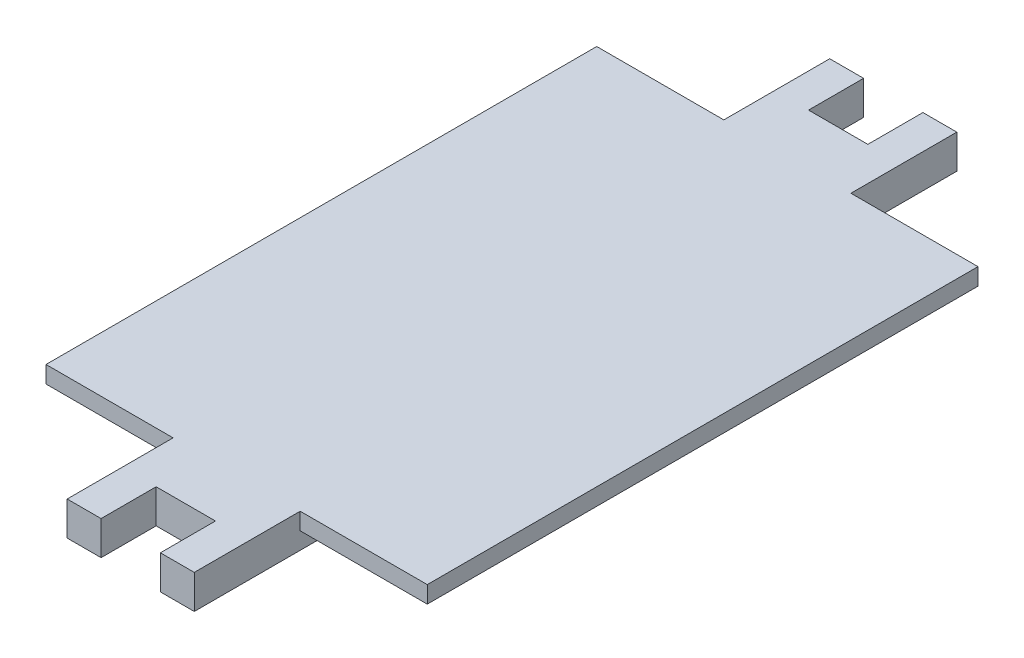
ISO-10303-21;
HEADER;
FILE_DESCRIPTION(('STEP AP214'),'2;1');
FILE_NAME('part.step','',(''),(''),'','','');
FILE_SCHEMA(('AUTOMOTIVE_DESIGN { 1 0 10303 214 1 1 1 1 }'));
ENDSEC;
DATA;
#1=APPLICATION_CONTEXT('core data for automotive mechanical design processes');
#2=APPLICATION_PROTOCOL_DEFINITION('international standard','automotive_design',2000,#1);
#3=PRODUCT_CONTEXT('',#1,'mechanical');
#4=PRODUCT('Part','Part','',(#3));
#5=PRODUCT_RELATED_PRODUCT_CATEGORY('part','',(#4));
#6=PRODUCT_DEFINITION_FORMATION('','',#4);
#7=PRODUCT_DEFINITION_CONTEXT('part definition',#1,'design');
#8=PRODUCT_DEFINITION('design','',#6,#7);
#9=PRODUCT_DEFINITION_SHAPE('','',#8);
#10=(LENGTH_UNIT() NAMED_UNIT(*) SI_UNIT(.MILLI.,.METRE.));
#11=(NAMED_UNIT(*) PLANE_ANGLE_UNIT() SI_UNIT($,.RADIAN.));
#12=(NAMED_UNIT(*) SI_UNIT($,.STERADIAN.) SOLID_ANGLE_UNIT());
#13=UNCERTAINTY_MEASURE_WITH_UNIT(LENGTH_MEASURE(1.E-05),#10,'distance_accuracy_value','');
#14=(GEOMETRIC_REPRESENTATION_CONTEXT(3) GLOBAL_UNCERTAINTY_ASSIGNED_CONTEXT((#13)) GLOBAL_UNIT_ASSIGNED_CONTEXT((#10,
#11,#12)) REPRESENTATION_CONTEXT('',''));
#15=CARTESIAN_POINT('',(0.,0.,0.));
#16=DIRECTION('',(0.,0.,1.));
#17=DIRECTION('',(1.,0.,0.));
#18=AXIS2_PLACEMENT_3D('',#15,#16,#17);
#19=CARTESIAN_POINT('',(0.,0.,-1.925));
#20=DIRECTION('',(0.,0.,-1.));
#21=DIRECTION('',(-1.,0.,0.));
#22=AXIS2_PLACEMENT_3D('',#19,#20,#21);
#23=PLANE('',#22);
#24=DIRECTION('',(0.,1.,0.));
#25=VECTOR('',#24,1.);
#26=CARTESIAN_POINT('',(-0.175,0.,-1.925));
#27=LINE('',#26,#25);
#28=CARTESIAN_POINT('',(-0.175,0.,-1.925));
#29=VERTEX_POINT('',#28);
#30=CARTESIAN_POINT('',(-0.175,0.2,-1.925));
#31=VERTEX_POINT('',#30);
#32=EDGE_CURVE('E11',#29,#31,#27,.T.);
#33=ORIENTED_EDGE('',*,*,#32,.T.);
#34=DIRECTION('',(1.,0.,0.));
#35=VECTOR('',#34,1.);
#36=CARTESIAN_POINT('',(-0.175,0.2,-1.925));
#37=LINE('',#36,#35);
#38=CARTESIAN_POINT('',(0.175,0.2,-1.925));
#39=VERTEX_POINT('',#38);
#40=EDGE_CURVE('E24',#31,#39,#37,.T.);
#41=ORIENTED_EDGE('',*,*,#40,.T.);
#42=DIRECTION('',(0.,1.,0.));
#43=VECTOR('',#42,1.);
#44=CARTESIAN_POINT('',(0.175,0.,-1.925));
#45=LINE('',#44,#43);
#46=CARTESIAN_POINT('',(0.175,0.,-1.925));
#47=VERTEX_POINT('',#46);
#48=EDGE_CURVE('E432',#47,#39,#45,.T.);
#49=ORIENTED_EDGE('',*,*,#48,.F.);
#50=DIRECTION('',(1.,0.,0.));
#51=VECTOR('',#50,1.);
#52=CARTESIAN_POINT('',(-0.175,0.,-1.925));
#53=LINE('',#52,#51);
#54=EDGE_CURVE('E36',#29,#47,#53,.T.);
#55=ORIENTED_EDGE('',*,*,#54,.F.);
#56=EDGE_LOOP('',(#33,#41,#49,#55));
#57=FACE_BOUND('',#56,.T.);
#58=ADVANCED_FACE('F17',(#57),#23,.T.);
#59=CARTESIAN_POINT('',(0.,0.,0.));
#60=DIRECTION('',(0.,-1.,0.));
#61=DIRECTION('',(-1.,0.,0.));
#62=AXIS2_PLACEMENT_3D('',#59,#60,#61);
#63=PLANE('',#62);
#64=DIRECTION('',(0.,0.,1.));
#65=VECTOR('',#64,1.);
#66=CARTESIAN_POINT('',(-0.175,0.,1.925));
#67=LINE('',#66,#65);
#68=CARTESIAN_POINT('',(-0.175,0.,1.925));
#69=VERTEX_POINT('',#68);
#70=CARTESIAN_POINT('',(-0.175,0.,2.25));
#71=VERTEX_POINT('',#70);
#72=EDGE_CURVE('E428',#69,#71,#67,.T.);
#73=ORIENTED_EDGE('',*,*,#72,.T.);
#74=DIRECTION('',(-1.,0.,0.));
#75=VECTOR('',#74,1.);
#76=CARTESIAN_POINT('',(-0.175,0.,2.25));
#77=LINE('',#76,#75);
#78=CARTESIAN_POINT('',(-0.375,0.,2.25));
#79=VERTEX_POINT('',#78);
#80=EDGE_CURVE('E425',#71,#79,#77,.T.);
#81=ORIENTED_EDGE('',*,*,#80,.T.);
#82=DIRECTION('',(0.,0.,-1.));
#83=VECTOR('',#82,1.);
#84=CARTESIAN_POINT('',(-0.375,0.,2.25));
#85=LINE('',#84,#83);
#86=CARTESIAN_POINT('',(-0.375,0.,1.525));
#87=VERTEX_POINT('',#86);
#88=EDGE_CURVE('E422',#79,#87,#85,.T.);
#89=ORIENTED_EDGE('',*,*,#88,.T.);
#90=DIRECTION('',(-1.,0.,0.));
#91=VECTOR('',#90,1.);
#92=CARTESIAN_POINT('',(-0.375,0.,1.525));
#93=LINE('',#92,#91);
#94=CARTESIAN_POINT('',(-1.025,0.,1.525));
#95=VERTEX_POINT('',#94);
#96=EDGE_CURVE('E419',#87,#95,#93,.T.);
#97=ORIENTED_EDGE('',*,*,#96,.T.);
#98=DIRECTION('',(0.,0.,-1.));
#99=VECTOR('',#98,1.);
#100=CARTESIAN_POINT('',(-1.025,0.,1.525));
#101=LINE('',#100,#99);
#102=CARTESIAN_POINT('',(-1.025,0.,-1.175));
#103=VERTEX_POINT('',#102);
#104=EDGE_CURVE('E416',#95,#103,#101,.T.);
#105=ORIENTED_EDGE('',*,*,#104,.T.);
#106=DIRECTION('',(0.707106781186548,0.,-0.707106781186548));
#107=VECTOR('',#106,1.);
#108=CARTESIAN_POINT('',(-1.025,0.,-1.175));
#109=LINE('',#108,#107);
#110=CARTESIAN_POINT('',(-0.675,0.,-1.525));
#111=VERTEX_POINT('',#110);
#112=EDGE_CURVE('E413',#103,#111,#109,.T.);
#113=ORIENTED_EDGE('',*,*,#112,.T.);
#114=DIRECTION('',(1.,0.,0.));
#115=VECTOR('',#114,1.);
#116=CARTESIAN_POINT('',(-0.675,0.,-1.525));
#117=LINE('',#116,#115);
#118=CARTESIAN_POINT('',(-0.375,0.,-1.525));
#119=VERTEX_POINT('',#118);
#120=EDGE_CURVE('E410',#111,#119,#117,.T.);
#121=ORIENTED_EDGE('',*,*,#120,.T.);
#122=DIRECTION('',(0.,0.,1.));
#123=VECTOR('',#122,1.);
#124=CARTESIAN_POINT('',(-0.375,0.,-2.25));
#125=LINE('',#124,#123);
#126=CARTESIAN_POINT('',(-0.375,0.,-2.25));
#127=VERTEX_POINT('',#126);
#128=EDGE_CURVE('E408',#127,#119,#125,.T.);
#129=ORIENTED_EDGE('',*,*,#128,.F.);
#130=DIRECTION('',(-1.,0.,0.));
#131=VECTOR('',#130,1.);
#132=CARTESIAN_POINT('',(-0.175,0.,-2.25));
#133=LINE('',#132,#131);
#134=CARTESIAN_POINT('',(-0.175,0.,-2.25));
#135=VERTEX_POINT('',#134);
#136=EDGE_CURVE('E406',#135,#127,#133,.T.);
#137=ORIENTED_EDGE('',*,*,#136,.F.);
#138=DIRECTION('',(0.,0.,-1.));
#139=VECTOR('',#138,1.);
#140=CARTESIAN_POINT('',(-0.175,0.,-1.925));
#141=LINE('',#140,#139);
#142=EDGE_CURVE('E404',#29,#135,#141,.T.);
#143=ORIENTED_EDGE('',*,*,#142,.F.);
#144=ORIENTED_EDGE('',*,*,#54,.T.);
#145=DIRECTION('',(0.,0.,-1.));
#146=VECTOR('',#145,1.);
#147=CARTESIAN_POINT('',(0.175,0.,-1.925));
#148=LINE('',#147,#146);
#149=CARTESIAN_POINT('',(0.175,0.,-2.25));
#150=VERTEX_POINT('',#149);
#151=EDGE_CURVE('E401',#47,#150,#148,.T.);
#152=ORIENTED_EDGE('',*,*,#151,.T.);
#153=DIRECTION('',(1.,0.,0.));
#154=VECTOR('',#153,1.);
#155=CARTESIAN_POINT('',(0.175,0.,-2.25));
#156=LINE('',#155,#154);
#157=CARTESIAN_POINT('',(0.375,0.,-2.25));
#158=VERTEX_POINT('',#157);
#159=EDGE_CURVE('E398',#150,#158,#156,.T.);
#160=ORIENTED_EDGE('',*,*,#159,.T.);
#161=DIRECTION('',(0.,0.,1.));
#162=VECTOR('',#161,1.);
#163=CARTESIAN_POINT('',(0.375,0.,-2.25));
#164=LINE('',#163,#162);
#165=CARTESIAN_POINT('',(0.375,0.,-1.525));
#166=VERTEX_POINT('',#165);
#167=EDGE_CURVE('E395',#158,#166,#164,.T.);
#168=ORIENTED_EDGE('',*,*,#167,.T.);
#169=DIRECTION('',(1.,0.,0.));
#170=VECTOR('',#169,1.);
#171=CARTESIAN_POINT('',(0.375,0.,-1.525));
#172=LINE('',#171,#170);
#173=CARTESIAN_POINT('',(1.025,0.,-1.525));
#174=VERTEX_POINT('',#173);
#175=EDGE_CURVE('E392',#166,#174,#172,.T.);
#176=ORIENTED_EDGE('',*,*,#175,.T.);
#177=DIRECTION('',(0.,0.,1.));
#178=VECTOR('',#177,1.);
#179=CARTESIAN_POINT('',(1.025,0.,-1.525));
#180=LINE('',#179,#178);
#181=CARTESIAN_POINT('',(1.025,0.,1.525));
#182=VERTEX_POINT('',#181);
#183=EDGE_CURVE('E389',#174,#182,#180,.T.);
#184=ORIENTED_EDGE('',*,*,#183,.T.);
#185=DIRECTION('',(-1.,0.,0.));
#186=VECTOR('',#185,1.);
#187=CARTESIAN_POINT('',(1.025,0.,1.525));
#188=LINE('',#187,#186);
#189=CARTESIAN_POINT('',(0.375,0.,1.525));
#190=VERTEX_POINT('',#189);
#191=EDGE_CURVE('E386',#182,#190,#188,.T.);
#192=ORIENTED_EDGE('',*,*,#191,.T.);
#193=DIRECTION('',(0.,0.,-1.));
#194=VECTOR('',#193,1.);
#195=CARTESIAN_POINT('',(0.375,0.,2.25));
#196=LINE('',#195,#194);
#197=CARTESIAN_POINT('',(0.375,0.,2.25));
#198=VERTEX_POINT('',#197);
#199=EDGE_CURVE('E384',#198,#190,#196,.T.);
#200=ORIENTED_EDGE('',*,*,#199,.F.);
#201=DIRECTION('',(1.,0.,0.));
#202=VECTOR('',#201,1.);
#203=CARTESIAN_POINT('',(0.175,0.,2.25));
#204=LINE('',#203,#202);
#205=CARTESIAN_POINT('',(0.175,0.,2.25));
#206=VERTEX_POINT('',#205);
#207=EDGE_CURVE('E382',#206,#198,#204,.T.);
#208=ORIENTED_EDGE('',*,*,#207,.F.);
#209=DIRECTION('',(0.,0.,1.));
#210=VECTOR('',#209,1.);
#211=CARTESIAN_POINT('',(0.175,0.,1.925));
#212=LINE('',#211,#210);
#213=CARTESIAN_POINT('',(0.175,0.,1.925));
#214=VERTEX_POINT('',#213);
#215=EDGE_CURVE('E380',#214,#206,#212,.T.);
#216=ORIENTED_EDGE('',*,*,#215,.F.);
#217=DIRECTION('',(-1.,0.,0.));
#218=VECTOR('',#217,1.);
#219=CARTESIAN_POINT('',(0.175,0.,1.925));
#220=LINE('',#219,#218);
#221=EDGE_CURVE('E378',#214,#69,#220,.T.);
#222=ORIENTED_EDGE('',*,*,#221,.T.);
#223=EDGE_LOOP('',(#73,#81,#89,#97,#105,#113,#121,#129,#137,#143,#144,#152,#160,#168,#176,#184,
#192,#200,#208,#216,#222));
#224=FACE_BOUND('',#223,.T.);
#225=ADVANCED_FACE('F444',(#224),#63,.T.);
#226=CARTESIAN_POINT('',(0.,0.,1.925));
#227=DIRECTION('',(0.,0.,-1.));
#228=DIRECTION('',(-1.,0.,0.));
#229=AXIS2_PLACEMENT_3D('',#226,#227,#228);
#230=PLANE('',#229);
#231=DIRECTION('',(0.,1.,0.));
#232=VECTOR('',#231,1.);
#233=CARTESIAN_POINT('',(-0.175,0.,1.925));
#234=LINE('',#233,#232);
#235=CARTESIAN_POINT('',(-0.175,0.2,1.925));
#236=VERTEX_POINT('',#235);
#237=EDGE_CURVE('E375',#69,#236,#234,.T.);
#238=ORIENTED_EDGE('',*,*,#237,.F.);
#239=ORIENTED_EDGE('',*,*,#221,.F.);
#240=DIRECTION('',(0.,1.,0.));
#241=VECTOR('',#240,1.);
#242=CARTESIAN_POINT('',(0.175,0.,1.925));
#243=LINE('',#242,#241);
#244=CARTESIAN_POINT('',(0.175,0.2,1.925));
#245=VERTEX_POINT('',#244);
#246=EDGE_CURVE('E372',#214,#245,#243,.T.);
#247=ORIENTED_EDGE('',*,*,#246,.T.);
#248=DIRECTION('',(-1.,0.,0.));
#249=VECTOR('',#248,1.);
#250=CARTESIAN_POINT('',(0.175,0.2,1.925));
#251=LINE('',#250,#249);
#252=EDGE_CURVE('E370',#245,#236,#251,.T.);
#253=ORIENTED_EDGE('',*,*,#252,.T.);
#254=EDGE_LOOP('',(#238,#239,#247,#253));
#255=FACE_BOUND('',#254,.T.);
#256=ADVANCED_FACE('F491',(#255),#230,.F.);
#257=CARTESIAN_POINT('',(0.,0.2,0.));
#258=DIRECTION('',(0.,1.,0.));
#259=DIRECTION('',(1.,0.,0.));
#260=AXIS2_PLACEMENT_3D('',#257,#258,#259);
#261=PLANE('',#260);
#262=DIRECTION('',(0.,0.,-1.));
#263=VECTOR('',#262,1.);
#264=CARTESIAN_POINT('',(1.125,0.2,1.625));
#265=LINE('',#264,#263);
#266=CARTESIAN_POINT('',(1.125,0.2,1.625));
#267=VERTEX_POINT('',#266);
#268=CARTESIAN_POINT('',(1.125,0.2,-1.625));
#269=VERTEX_POINT('',#268);
#270=EDGE_CURVE('E368',#267,#269,#265,.T.);
#271=ORIENTED_EDGE('',*,*,#270,.T.);
#272=DIRECTION('',(-1.,0.,0.));
#273=VECTOR('',#272,1.);
#274=CARTESIAN_POINT('',(1.125,0.2,-1.625));
#275=LINE('',#274,#273);
#276=CARTESIAN_POINT('',(0.375,0.2,-1.625));
#277=VERTEX_POINT('',#276);
#278=EDGE_CURVE('E232',#269,#277,#275,.T.);
#279=ORIENTED_EDGE('',*,*,#278,.T.);
#280=DIRECTION('',(0.,0.,1.));
#281=VECTOR('',#280,1.);
#282=CARTESIAN_POINT('',(0.375,0.2,-2.25));
#283=LINE('',#282,#281);
#284=CARTESIAN_POINT('',(0.375,0.2,-2.25));
#285=VERTEX_POINT('',#284);
#286=EDGE_CURVE('E365',#285,#277,#283,.T.);
#287=ORIENTED_EDGE('',*,*,#286,.F.);
#288=DIRECTION('',(1.,0.,0.));
#289=VECTOR('',#288,1.);
#290=CARTESIAN_POINT('',(0.175,0.2,-2.25));
#291=LINE('',#290,#289);
#292=CARTESIAN_POINT('',(0.175,0.2,-2.25));
#293=VERTEX_POINT('',#292);
#294=EDGE_CURVE('E363',#293,#285,#291,.T.);
#295=ORIENTED_EDGE('',*,*,#294,.F.);
#296=DIRECTION('',(0.,0.,-1.));
#297=VECTOR('',#296,1.);
#298=CARTESIAN_POINT('',(0.175,0.2,-1.925));
#299=LINE('',#298,#297);
#300=EDGE_CURVE('E361',#39,#293,#299,.T.);
#301=ORIENTED_EDGE('',*,*,#300,.F.);
#302=ORIENTED_EDGE('',*,*,#40,.F.);
#303=DIRECTION('',(0.,0.,-1.));
#304=VECTOR('',#303,1.);
#305=CARTESIAN_POINT('',(-0.175,0.2,-1.925));
#306=LINE('',#305,#304);
#307=CARTESIAN_POINT('',(-0.175,0.2,-2.25));
#308=VERTEX_POINT('',#307);
#309=EDGE_CURVE('E359',#31,#308,#306,.T.);
#310=ORIENTED_EDGE('',*,*,#309,.T.);
#311=DIRECTION('',(-1.,0.,0.));
#312=VECTOR('',#311,1.);
#313=CARTESIAN_POINT('',(-0.175,0.2,-2.25));
#314=LINE('',#313,#312);
#315=CARTESIAN_POINT('',(-0.375,0.2,-2.25));
#316=VERTEX_POINT('',#315);
#317=EDGE_CURVE('E356',#308,#316,#314,.T.);
#318=ORIENTED_EDGE('',*,*,#317,.T.);
#319=DIRECTION('',(0.,0.,1.));
#320=VECTOR('',#319,1.);
#321=CARTESIAN_POINT('',(-0.375,0.2,-2.25));
#322=LINE('',#321,#320);
#323=CARTESIAN_POINT('',(-0.375,0.2,-1.625));
#324=VERTEX_POINT('',#323);
#325=EDGE_CURVE('E353',#316,#324,#322,.T.);
#326=ORIENTED_EDGE('',*,*,#325,.T.);
#327=DIRECTION('',(-1.,0.,0.));
#328=VECTOR('',#327,1.);
#329=CARTESIAN_POINT('',(-0.375,0.2,-1.625));
#330=LINE('',#329,#328);
#331=CARTESIAN_POINT('',(-1.125,0.2,-1.625));
#332=VERTEX_POINT('',#331);
#333=EDGE_CURVE('E350',#324,#332,#330,.T.);
#334=ORIENTED_EDGE('',*,*,#333,.T.);
#335=DIRECTION('',(0.,0.,1.));
#336=VECTOR('',#335,1.);
#337=CARTESIAN_POINT('',(-1.125,0.2,-1.625));
#338=LINE('',#337,#336);
#339=CARTESIAN_POINT('',(-1.125,0.2,1.625));
#340=VERTEX_POINT('',#339);
#341=EDGE_CURVE('E347',#332,#340,#338,.T.);
#342=ORIENTED_EDGE('',*,*,#341,.T.);
#343=DIRECTION('',(1.,0.,0.));
#344=VECTOR('',#343,1.);
#345=CARTESIAN_POINT('',(-1.125,0.2,1.625));
#346=LINE('',#345,#344);
#347=CARTESIAN_POINT('',(-0.375,0.2,1.625));
#348=VERTEX_POINT('',#347);
#349=EDGE_CURVE('E344',#340,#348,#346,.T.);
#350=ORIENTED_EDGE('',*,*,#349,.T.);
#351=DIRECTION('',(0.,0.,-1.));
#352=VECTOR('',#351,1.);
#353=CARTESIAN_POINT('',(-0.375,0.2,2.25));
#354=LINE('',#353,#352);
#355=CARTESIAN_POINT('',(-0.375,0.2,2.25));
#356=VERTEX_POINT('',#355);
#357=EDGE_CURVE('E342',#356,#348,#354,.T.);
#358=ORIENTED_EDGE('',*,*,#357,.F.);
#359=DIRECTION('',(-1.,0.,0.));
#360=VECTOR('',#359,1.);
#361=CARTESIAN_POINT('',(-0.175,0.2,2.25));
#362=LINE('',#361,#360);
#363=CARTESIAN_POINT('',(-0.175,0.2,2.25));
#364=VERTEX_POINT('',#363);
#365=EDGE_CURVE('E340',#364,#356,#362,.T.);
#366=ORIENTED_EDGE('',*,*,#365,.F.);
#367=DIRECTION('',(0.,0.,1.));
#368=VECTOR('',#367,1.);
#369=CARTESIAN_POINT('',(-0.175,0.2,1.925));
#370=LINE('',#369,#368);
#371=EDGE_CURVE('E338',#236,#364,#370,.T.);
#372=ORIENTED_EDGE('',*,*,#371,.F.);
#373=ORIENTED_EDGE('',*,*,#252,.F.);
#374=DIRECTION('',(0.,0.,1.));
#375=VECTOR('',#374,1.);
#376=CARTESIAN_POINT('',(0.175,0.2,1.925));
#377=LINE('',#376,#375);
#378=CARTESIAN_POINT('',(0.175,0.2,2.25));
#379=VERTEX_POINT('',#378);
#380=EDGE_CURVE('E335',#245,#379,#377,.T.);
#381=ORIENTED_EDGE('',*,*,#380,.T.);
#382=DIRECTION('',(1.,0.,0.));
#383=VECTOR('',#382,1.);
#384=CARTESIAN_POINT('',(0.175,0.2,2.25));
#385=LINE('',#384,#383);
#386=CARTESIAN_POINT('',(0.375,0.2,2.25));
#387=VERTEX_POINT('',#386);
#388=EDGE_CURVE('E332',#379,#387,#385,.T.);
#389=ORIENTED_EDGE('',*,*,#388,.T.);
#390=DIRECTION('',(0.,0.,-1.));
#391=VECTOR('',#390,1.);
#392=CARTESIAN_POINT('',(0.375,0.2,2.25));
#393=LINE('',#392,#391);
#394=CARTESIAN_POINT('',(0.375,0.2,1.625));
#395=VERTEX_POINT('',#394);
#396=EDGE_CURVE('E329',#387,#395,#393,.T.);
#397=ORIENTED_EDGE('',*,*,#396,.T.);
#398=DIRECTION('',(1.,0.,0.));
#399=VECTOR('',#398,1.);
#400=CARTESIAN_POINT('',(0.375,0.2,1.625));
#401=LINE('',#400,#399);
#402=EDGE_CURVE('E327',#395,#267,#401,.T.);
#403=ORIENTED_EDGE('',*,*,#402,.T.);
#404=EDGE_LOOP('',(#271,#279,#287,#295,#301,#302,#310,#318,#326,#334,#342,#350,#358,#366,#372,
#373,#381,#389,#397,#403));
#405=FACE_BOUND('',#404,.T.);
#406=ADVANCED_FACE('F436',(#405),#261,.T.);
#407=CARTESIAN_POINT('',(-1.125,0.1,1.625));
#408=DIRECTION('',(0.,0.,1.));
#409=DIRECTION('',(1.,0.,0.));
#410=AXIS2_PLACEMENT_3D('',#407,#408,#409);
#411=PLANE('',#410);
#412=ORIENTED_EDGE('',*,*,#349,.F.);
#413=DIRECTION('',(0.,1.,0.));
#414=VECTOR('',#413,1.);
#415=CARTESIAN_POINT('',(-1.125,0.1,1.625));
#416=LINE('',#415,#414);
#417=CARTESIAN_POINT('',(-1.125,0.1,1.625));
#418=VERTEX_POINT('',#417);
#419=EDGE_CURVE('E324',#418,#340,#416,.T.);
#420=ORIENTED_EDGE('',*,*,#419,.F.);
#421=DIRECTION('',(1.,0.,0.));
#422=VECTOR('',#421,1.);
#423=CARTESIAN_POINT('',(-1.125,0.1,1.625));
#424=LINE('',#423,#422);
#425=CARTESIAN_POINT('',(-0.375,0.1,1.625));
#426=VERTEX_POINT('',#425);
#427=EDGE_CURVE('E321',#418,#426,#424,.T.);
#428=ORIENTED_EDGE('',*,*,#427,.T.);
#429=DIRECTION('',(0.,1.,0.));
#430=VECTOR('',#429,1.);
#431=CARTESIAN_POINT('',(-0.375,0.1,1.625));
#432=LINE('',#431,#430);
#433=EDGE_CURVE('E318',#426,#348,#432,.T.);
#434=ORIENTED_EDGE('',*,*,#433,.T.);
#435=EDGE_LOOP('',(#412,#420,#428,#434));
#436=FACE_BOUND('',#435,.T.);
#437=ADVANCED_FACE('F475',(#436),#411,.T.);
#438=CARTESIAN_POINT('',(-1.125,0.1,1.625));
#439=DIRECTION('',(0.,0.,1.));
#440=DIRECTION('',(1.,0.,0.));
#441=AXIS2_PLACEMENT_3D('',#438,#439,#440);
#442=PLANE('',#441);
#443=DIRECTION('',(1.,0.,0.));
#444=VECTOR('',#443,1.);
#445=CARTESIAN_POINT('',(0.375,0.1,1.625));
#446=LINE('',#445,#444);
#447=CARTESIAN_POINT('',(0.375,0.1,1.625));
#448=VERTEX_POINT('',#447);
#449=CARTESIAN_POINT('',(1.125,0.1,1.625));
#450=VERTEX_POINT('',#449);
#451=EDGE_CURVE('E316',#448,#450,#446,.T.);
#452=ORIENTED_EDGE('',*,*,#451,.T.);
#453=DIRECTION('',(0.,1.,0.));
#454=VECTOR('',#453,1.);
#455=CARTESIAN_POINT('',(1.125,0.1,1.625));
#456=LINE('',#455,#454);
#457=EDGE_CURVE('E214',#450,#267,#456,.T.);
#458=ORIENTED_EDGE('',*,*,#457,.T.);
#459=ORIENTED_EDGE('',*,*,#402,.F.);
#460=DIRECTION('',(0.,1.,0.));
#461=VECTOR('',#460,1.);
#462=CARTESIAN_POINT('',(0.375,0.1,1.625));
#463=LINE('',#462,#461);
#464=EDGE_CURVE('E312',#448,#395,#463,.T.);
#465=ORIENTED_EDGE('',*,*,#464,.F.);
#466=EDGE_LOOP('',(#452,#458,#459,#465));
#467=FACE_BOUND('',#466,.T.);
#468=ADVANCED_FACE('F528',(#467),#442,.T.);
#469=CARTESIAN_POINT('',(-0.375,0.,2.25));
#470=DIRECTION('',(1.,0.,0.));
#471=DIRECTION('',(0.,0.,-1.));
#472=AXIS2_PLACEMENT_3D('',#469,#470,#471);
#473=PLANE('',#472);
#474=DIRECTION('',(0.,1.,0.));
#475=VECTOR('',#474,1.);
#476=CARTESIAN_POINT('',(-0.375,0.,2.25));
#477=LINE('',#476,#475);
#478=EDGE_CURVE('E309',#79,#356,#477,.T.);
#479=ORIENTED_EDGE('',*,*,#478,.T.);
#480=ORIENTED_EDGE('',*,*,#357,.T.);
#481=ORIENTED_EDGE('',*,*,#433,.F.);
#482=DIRECTION('',(0.,0.,-1.));
#483=VECTOR('',#482,1.);
#484=CARTESIAN_POINT('',(-0.375,0.1,1.625));
#485=LINE('',#484,#483);
#486=CARTESIAN_POINT('',(-0.375,0.1,1.525));
#487=VERTEX_POINT('',#486);
#488=EDGE_CURVE('E306',#426,#487,#485,.T.);
#489=ORIENTED_EDGE('',*,*,#488,.T.);
#490=DIRECTION('',(0.,-1.,0.));
#491=VECTOR('',#490,1.);
#492=CARTESIAN_POINT('',(-0.375,0.1,1.525));
#493=LINE('',#492,#491);
#494=EDGE_CURVE('E303',#487,#87,#493,.T.);
#495=ORIENTED_EDGE('',*,*,#494,.T.);
#496=ORIENTED_EDGE('',*,*,#88,.F.);
#497=EDGE_LOOP('',(#479,#480,#481,#489,#495,#496));
#498=FACE_BOUND('',#497,.T.);
#499=ADVANCED_FACE('F477',(#498),#473,.F.);
#500=CARTESIAN_POINT('',(1.025,0.1,1.525));
#501=DIRECTION('',(0.,0.,1.));
#502=DIRECTION('',(-1.,0.,0.));
#503=AXIS2_PLACEMENT_3D('',#500,#501,#502);
#504=PLANE('',#503);
#505=DIRECTION('',(-1.,0.,0.));
#506=VECTOR('',#505,1.);
#507=CARTESIAN_POINT('',(-0.375,0.1,1.525));
#508=LINE('',#507,#506);
#509=CARTESIAN_POINT('',(-1.025,0.1,1.525));
#510=VERTEX_POINT('',#509);
#511=EDGE_CURVE('E300',#487,#510,#508,.T.);
#512=ORIENTED_EDGE('',*,*,#511,.T.);
#513=DIRECTION('',(0.,-1.,0.));
#514=VECTOR('',#513,1.);
#515=CARTESIAN_POINT('',(-1.025,0.1,1.525));
#516=LINE('',#515,#514);
#517=EDGE_CURVE('E297',#510,#95,#516,.T.);
#518=ORIENTED_EDGE('',*,*,#517,.T.);
#519=ORIENTED_EDGE('',*,*,#96,.F.);
#520=ORIENTED_EDGE('',*,*,#494,.F.);
#521=EDGE_LOOP('',(#512,#518,#519,#520));
#522=FACE_BOUND('',#521,.T.);
#523=ADVANCED_FACE('F536',(#522),#504,.T.);
#524=CARTESIAN_POINT('',(1.025,0.1,1.525));
#525=DIRECTION('',(0.,0.,1.));
#526=DIRECTION('',(-1.,0.,0.));
#527=AXIS2_PLACEMENT_3D('',#524,#525,#526);
#528=PLANE('',#527);
#529=ORIENTED_EDGE('',*,*,#191,.F.);
#530=DIRECTION('',(0.,-1.,0.));
#531=VECTOR('',#530,1.);
#532=CARTESIAN_POINT('',(1.025,0.1,1.525));
#533=LINE('',#532,#531);
#534=CARTESIAN_POINT('',(1.025,0.1,1.525));
#535=VERTEX_POINT('',#534);
#536=EDGE_CURVE('E294',#535,#182,#533,.T.);
#537=ORIENTED_EDGE('',*,*,#536,.F.);
#538=DIRECTION('',(-1.,0.,0.));
#539=VECTOR('',#538,1.);
#540=CARTESIAN_POINT('',(1.025,0.1,1.525));
#541=LINE('',#540,#539);
#542=CARTESIAN_POINT('',(0.375,0.1,1.525));
#543=VERTEX_POINT('',#542);
#544=EDGE_CURVE('E291',#535,#543,#541,.T.);
#545=ORIENTED_EDGE('',*,*,#544,.T.);
#546=DIRECTION('',(0.,-1.,0.));
#547=VECTOR('',#546,1.);
#548=CARTESIAN_POINT('',(0.375,0.1,1.525));
#549=LINE('',#548,#547);
#550=EDGE_CURVE('E288',#543,#190,#549,.T.);
#551=ORIENTED_EDGE('',*,*,#550,.T.);
#552=EDGE_LOOP('',(#529,#537,#545,#551));
#553=FACE_BOUND('',#552,.T.);
#554=ADVANCED_FACE('F524',(#553),#528,.T.);
#555=CARTESIAN_POINT('',(-1.025,0.1,1.525));
#556=DIRECTION('',(-1.,0.,0.));
#557=DIRECTION('',(0.,0.,-1.));
#558=AXIS2_PLACEMENT_3D('',#555,#556,#557);
#559=PLANE('',#558);
#560=ORIENTED_EDGE('',*,*,#104,.F.);
#561=ORIENTED_EDGE('',*,*,#517,.F.);
#562=DIRECTION('',(0.,0.,-1.));
#563=VECTOR('',#562,1.);
#564=CARTESIAN_POINT('',(-1.025,0.1,1.525));
#565=LINE('',#564,#563);
#566=CARTESIAN_POINT('',(-1.025,0.1,-1.175));
#567=VERTEX_POINT('',#566);
#568=EDGE_CURVE('E285',#510,#567,#565,.T.);
#569=ORIENTED_EDGE('',*,*,#568,.T.);
#570=DIRECTION('',(0.,1.,0.));
#571=VECTOR('',#570,1.);
#572=CARTESIAN_POINT('',(-1.025,0.,-1.175));
#573=LINE('',#572,#571);
#574=EDGE_CURVE('E283',#103,#567,#573,.T.);
#575=ORIENTED_EDGE('',*,*,#574,.F.);
#576=EDGE_LOOP('',(#560,#561,#569,#575));
#577=FACE_BOUND('',#576,.T.);
#578=ADVANCED_FACE('F590',(#577),#559,.T.);
#579=CARTESIAN_POINT('',(-0.85,0.05,-1.35));
#580=DIRECTION('',(-0.707106781186548,0.,-0.707106781186548));
#581=DIRECTION('',(-0.707106781186548,0.,0.707106781186548));
#582=AXIS2_PLACEMENT_3D('',#579,#580,#581);
#583=PLANE('',#582);
#584=DIRECTION('',(-0.707106781186548,0.,0.707106781186548));
#585=VECTOR('',#584,1.);
#586=CARTESIAN_POINT('',(-0.675,0.1,-1.525));
#587=LINE('',#586,#585);
#588=CARTESIAN_POINT('',(-0.675,0.1,-1.525));
#589=VERTEX_POINT('',#588);
#590=EDGE_CURVE('E280',#589,#567,#587,.T.);
#591=ORIENTED_EDGE('',*,*,#590,.F.);
#592=DIRECTION('',(0.,1.,0.));
#593=VECTOR('',#592,1.);
#594=CARTESIAN_POINT('',(-0.675,0.,-1.525));
#595=LINE('',#594,#593);
#596=EDGE_CURVE('E278',#111,#589,#595,.T.);
#597=ORIENTED_EDGE('',*,*,#596,.F.);
#598=ORIENTED_EDGE('',*,*,#112,.F.);
#599=ORIENTED_EDGE('',*,*,#574,.T.);
#600=EDGE_LOOP('',(#591,#597,#598,#599));
#601=FACE_BOUND('',#600,.T.);
#602=ADVANCED_FACE('F599',(#601),#583,.T.);
#603=CARTESIAN_POINT('',(-1.025,0.1,-1.525));
#604=DIRECTION('',(0.,0.,-1.));
#605=DIRECTION('',(1.,0.,0.));
#606=AXIS2_PLACEMENT_3D('',#603,#604,#605);
#607=PLANE('',#606);
#608=ORIENTED_EDGE('',*,*,#120,.F.);
#609=ORIENTED_EDGE('',*,*,#596,.T.);
#610=DIRECTION('',(1.,0.,0.));
#611=VECTOR('',#610,1.);
#612=CARTESIAN_POINT('',(-0.675,0.1,-1.525));
#613=LINE('',#612,#611);
#614=CARTESIAN_POINT('',(-0.375,0.1,-1.525));
#615=VERTEX_POINT('',#614);
#616=EDGE_CURVE('E275',#589,#615,#613,.T.);
#617=ORIENTED_EDGE('',*,*,#616,.T.);
#618=DIRECTION('',(0.,-1.,0.));
#619=VECTOR('',#618,1.);
#620=CARTESIAN_POINT('',(-0.375,0.1,-1.525));
#621=LINE('',#620,#619);
#622=EDGE_CURVE('E272',#615,#119,#621,.T.);
#623=ORIENTED_EDGE('',*,*,#622,.T.);
#624=EDGE_LOOP('',(#608,#609,#617,#623));
#625=FACE_BOUND('',#624,.T.);
#626=ADVANCED_FACE('F609',(#625),#607,.T.);
#627=CARTESIAN_POINT('',(-1.025,0.1,-1.525));
#628=DIRECTION('',(0.,0.,-1.));
#629=DIRECTION('',(1.,0.,0.));
#630=AXIS2_PLACEMENT_3D('',#627,#628,#629);
#631=PLANE('',#630);
#632=DIRECTION('',(1.,0.,0.));
#633=VECTOR('',#632,1.);
#634=CARTESIAN_POINT('',(0.375,0.1,-1.525));
#635=LINE('',#634,#633);
#636=CARTESIAN_POINT('',(0.375,0.1,-1.525));
#637=VERTEX_POINT('',#636);
#638=CARTESIAN_POINT('',(1.025,0.1,-1.525));
#639=VERTEX_POINT('',#638);
#640=EDGE_CURVE('E269',#637,#639,#635,.T.);
#641=ORIENTED_EDGE('',*,*,#640,.T.);
#642=DIRECTION('',(0.,-1.,0.));
#643=VECTOR('',#642,1.);
#644=CARTESIAN_POINT('',(1.025,0.1,-1.525));
#645=LINE('',#644,#643);
#646=EDGE_CURVE('E266',#639,#174,#645,.T.);
#647=ORIENTED_EDGE('',*,*,#646,.T.);
#648=ORIENTED_EDGE('',*,*,#175,.F.);
#649=DIRECTION('',(0.,-1.,0.));
#650=VECTOR('',#649,1.);
#651=CARTESIAN_POINT('',(0.375,0.1,-1.525));
#652=LINE('',#651,#650);
#653=EDGE_CURVE('E263',#637,#166,#652,.T.);
#654=ORIENTED_EDGE('',*,*,#653,.F.);
#655=EDGE_LOOP('',(#641,#647,#648,#654));
#656=FACE_BOUND('',#655,.T.);
#657=ADVANCED_FACE('F518',(#656),#631,.T.);
#658=CARTESIAN_POINT('',(-0.375,0.,-2.25));
#659=DIRECTION('',(-1.,0.,0.));
#660=DIRECTION('',(0.,0.,1.));
#661=AXIS2_PLACEMENT_3D('',#658,#659,#660);
#662=PLANE('',#661);
#663=DIRECTION('',(0.,1.,0.));
#664=VECTOR('',#663,1.);
#665=CARTESIAN_POINT('',(-0.375,0.1,-1.625));
#666=LINE('',#665,#664);
#667=CARTESIAN_POINT('',(-0.375,0.1,-1.625));
#668=VERTEX_POINT('',#667);
#669=EDGE_CURVE('E260',#668,#324,#666,.T.);
#670=ORIENTED_EDGE('',*,*,#669,.T.);
#671=ORIENTED_EDGE('',*,*,#325,.F.);
#672=DIRECTION('',(0.,1.,0.));
#673=VECTOR('',#672,1.);
#674=CARTESIAN_POINT('',(-0.375,0.,-2.25));
#675=LINE('',#674,#673);
#676=EDGE_CURVE('E257',#127,#316,#675,.T.);
#677=ORIENTED_EDGE('',*,*,#676,.F.);
#678=ORIENTED_EDGE('',*,*,#128,.T.);
#679=ORIENTED_EDGE('',*,*,#622,.F.);
#680=DIRECTION('',(0.,0.,1.));
#681=VECTOR('',#680,1.);
#682=CARTESIAN_POINT('',(-0.375,0.1,-1.625));
#683=LINE('',#682,#681);
#684=EDGE_CURVE('E254',#668,#615,#683,.T.);
#685=ORIENTED_EDGE('',*,*,#684,.F.);
#686=EDGE_LOOP('',(#670,#671,#677,#678,#679,#685));
#687=FACE_BOUND('',#686,.T.);
#688=ADVANCED_FACE('F458',(#687),#662,.T.);
#689=CARTESIAN_POINT('',(0.,0.1,0.));
#690=DIRECTION('',(0.,1.,0.));
#691=DIRECTION('',(1.,0.,0.));
#692=AXIS2_PLACEMENT_3D('',#689,#690,#691);
#693=PLANE('',#692);
#694=ORIENTED_EDGE('',*,*,#427,.F.);
#695=DIRECTION('',(0.,0.,1.));
#696=VECTOR('',#695,1.);
#697=CARTESIAN_POINT('',(-1.125,0.1,-1.625));
#698=LINE('',#697,#696);
#699=CARTESIAN_POINT('',(-1.125,0.1,-1.625));
#700=VERTEX_POINT('',#699);
#701=EDGE_CURVE('E251',#700,#418,#698,.T.);
#702=ORIENTED_EDGE('',*,*,#701,.F.);
#703=DIRECTION('',(-1.,0.,0.));
#704=VECTOR('',#703,1.);
#705=CARTESIAN_POINT('',(-0.375,0.1,-1.625));
#706=LINE('',#705,#704);
#707=EDGE_CURVE('E249',#668,#700,#706,.T.);
#708=ORIENTED_EDGE('',*,*,#707,.F.);
#709=ORIENTED_EDGE('',*,*,#684,.T.);
#710=ORIENTED_EDGE('',*,*,#616,.F.);
#711=ORIENTED_EDGE('',*,*,#590,.T.);
#712=ORIENTED_EDGE('',*,*,#568,.F.);
#713=ORIENTED_EDGE('',*,*,#511,.F.);
#714=ORIENTED_EDGE('',*,*,#488,.F.);
#715=EDGE_LOOP('',(#694,#702,#708,#709,#710,#711,#712,#713,#714));
#716=FACE_BOUND('',#715,.T.);
#717=ADVANCED_FACE('F465',(#716),#693,.F.);
#718=CARTESIAN_POINT('',(0.,0.1,0.));
#719=DIRECTION('',(0.,1.,0.));
#720=DIRECTION('',(1.,0.,0.));
#721=AXIS2_PLACEMENT_3D('',#718,#719,#720);
#722=PLANE('',#721);
#723=ORIENTED_EDGE('',*,*,#544,.F.);
#724=DIRECTION('',(0.,0.,1.));
#725=VECTOR('',#724,1.);
#726=CARTESIAN_POINT('',(1.025,0.1,-1.525));
#727=LINE('',#726,#725);
#728=EDGE_CURVE('E246',#639,#535,#727,.T.);
#729=ORIENTED_EDGE('',*,*,#728,.F.);
#730=ORIENTED_EDGE('',*,*,#640,.F.);
#731=DIRECTION('',(0.,0.,1.));
#732=VECTOR('',#731,1.);
#733=CARTESIAN_POINT('',(0.375,0.1,-1.625));
#734=LINE('',#733,#732);
#735=CARTESIAN_POINT('',(0.375,0.1,-1.625));
#736=VERTEX_POINT('',#735);
#737=EDGE_CURVE('E225',#736,#637,#734,.T.);
#738=ORIENTED_EDGE('',*,*,#737,.F.);
#739=DIRECTION('',(-1.,0.,0.));
#740=VECTOR('',#739,1.);
#741=CARTESIAN_POINT('',(1.125,0.1,-1.625));
#742=LINE('',#741,#740);
#743=CARTESIAN_POINT('',(1.125,0.1,-1.625));
#744=VERTEX_POINT('',#743);
#745=EDGE_CURVE('E218',#744,#736,#742,.T.);
#746=ORIENTED_EDGE('',*,*,#745,.F.);
#747=DIRECTION('',(0.,0.,-1.));
#748=VECTOR('',#747,1.);
#749=CARTESIAN_POINT('',(1.125,0.1,1.625));
#750=LINE('',#749,#748);
#751=EDGE_CURVE('E207',#450,#744,#750,.T.);
#752=ORIENTED_EDGE('',*,*,#751,.F.);
#753=ORIENTED_EDGE('',*,*,#451,.F.);
#754=DIRECTION('',(0.,0.,-1.));
#755=VECTOR('',#754,1.);
#756=CARTESIAN_POINT('',(0.375,0.1,1.625));
#757=LINE('',#756,#755);
#758=EDGE_CURVE('E219',#448,#543,#757,.T.);
#759=ORIENTED_EDGE('',*,*,#758,.T.);
#760=EDGE_LOOP('',(#723,#729,#730,#738,#746,#752,#753,#759));
#761=FACE_BOUND('',#760,.T.);
#762=ADVANCED_FACE('F222',(#761),#722,.F.);
#763=CARTESIAN_POINT('',(1.125,0.1,-1.625));
#764=DIRECTION('',(0.,0.,-1.));
#765=DIRECTION('',(-1.,0.,0.));
#766=AXIS2_PLACEMENT_3D('',#763,#764,#765);
#767=PLANE('',#766);
#768=ORIENTED_EDGE('',*,*,#707,.T.);
#769=DIRECTION('',(0.,1.,0.));
#770=VECTOR('',#769,1.);
#771=CARTESIAN_POINT('',(-1.125,0.1,-1.625));
#772=LINE('',#771,#770);
#773=EDGE_CURVE('E234',#700,#332,#772,.T.);
#774=ORIENTED_EDGE('',*,*,#773,.T.);
#775=ORIENTED_EDGE('',*,*,#333,.F.);
#776=ORIENTED_EDGE('',*,*,#669,.F.);
#777=EDGE_LOOP('',(#768,#774,#775,#776));
#778=FACE_BOUND('',#777,.T.);
#779=ADVANCED_FACE('F462',(#778),#767,.T.);
#780=CARTESIAN_POINT('',(1.125,0.1,-1.625));
#781=DIRECTION('',(0.,0.,-1.));
#782=DIRECTION('',(-1.,0.,0.));
#783=AXIS2_PLACEMENT_3D('',#780,#781,#782);
#784=PLANE('',#783);
#785=ORIENTED_EDGE('',*,*,#278,.F.);
#786=DIRECTION('',(0.,1.,0.));
#787=VECTOR('',#786,1.);
#788=CARTESIAN_POINT('',(1.125,0.1,-1.625));
#789=LINE('',#788,#787);
#790=EDGE_CURVE('E212',#744,#269,#789,.T.);
#791=ORIENTED_EDGE('',*,*,#790,.F.);
#792=ORIENTED_EDGE('',*,*,#745,.T.);
#793=DIRECTION('',(0.,1.,0.));
#794=VECTOR('',#793,1.);
#795=CARTESIAN_POINT('',(0.375,0.1,-1.625));
#796=LINE('',#795,#794);
#797=EDGE_CURVE('E235',#736,#277,#796,.T.);
#798=ORIENTED_EDGE('',*,*,#797,.T.);
#799=EDGE_LOOP('',(#785,#791,#792,#798));
#800=FACE_BOUND('',#799,.T.);
#801=ADVANCED_FACE('F230',(#800),#784,.T.);
#802=CARTESIAN_POINT('',(-1.125,0.1,-1.625));
#803=DIRECTION('',(-1.,0.,0.));
#804=DIRECTION('',(0.,0.,1.));
#805=AXIS2_PLACEMENT_3D('',#802,#803,#804);
#806=PLANE('',#805);
#807=ORIENTED_EDGE('',*,*,#419,.T.);
#808=ORIENTED_EDGE('',*,*,#341,.F.);
#809=ORIENTED_EDGE('',*,*,#773,.F.);
#810=ORIENTED_EDGE('',*,*,#701,.T.);
#811=EDGE_LOOP('',(#807,#808,#809,#810));
#812=FACE_BOUND('',#811,.T.);
#813=ADVANCED_FACE('F471',(#812),#806,.T.);
#814=CARTESIAN_POINT('',(0.375,0.,-2.25));
#815=DIRECTION('',(-1.,0.,0.));
#816=DIRECTION('',(0.,0.,1.));
#817=AXIS2_PLACEMENT_3D('',#814,#815,#816);
#818=PLANE('',#817);
#819=DIRECTION('',(0.,1.,0.));
#820=VECTOR('',#819,1.);
#821=CARTESIAN_POINT('',(0.375,0.,-2.25));
#822=LINE('',#821,#820);
#823=EDGE_CURVE('E239',#158,#285,#822,.T.);
#824=ORIENTED_EDGE('',*,*,#823,.T.);
#825=ORIENTED_EDGE('',*,*,#286,.T.);
#826=ORIENTED_EDGE('',*,*,#797,.F.);
#827=ORIENTED_EDGE('',*,*,#737,.T.);
#828=ORIENTED_EDGE('',*,*,#653,.T.);
#829=ORIENTED_EDGE('',*,*,#167,.F.);
#830=EDGE_LOOP('',(#824,#825,#826,#827,#828,#829));
#831=FACE_BOUND('',#830,.T.);
#832=ADVANCED_FACE('F514',(#831),#818,.F.);
#833=CARTESIAN_POINT('',(0.175,0.,-2.25));
#834=DIRECTION('',(0.,0.,1.));
#835=DIRECTION('',(1.,0.,0.));
#836=AXIS2_PLACEMENT_3D('',#833,#834,#835);
#837=PLANE('',#836);
#838=DIRECTION('',(0.,1.,0.));
#839=VECTOR('',#838,1.);
#840=CARTESIAN_POINT('',(0.175,0.,-2.25));
#841=LINE('',#840,#839);
#842=EDGE_CURVE('E442',#150,#293,#841,.T.);
#843=ORIENTED_EDGE('',*,*,#842,.T.);
#844=ORIENTED_EDGE('',*,*,#294,.T.);
#845=ORIENTED_EDGE('',*,*,#823,.F.);
#846=ORIENTED_EDGE('',*,*,#159,.F.);
#847=EDGE_LOOP('',(#843,#844,#845,#846));
#848=FACE_BOUND('',#847,.T.);
#849=ADVANCED_FACE('F516',(#848),#837,.F.);
#850=CARTESIAN_POINT('',(0.175,0.,-1.925));
#851=DIRECTION('',(1.,0.,0.));
#852=DIRECTION('',(0.,0.,-1.));
#853=AXIS2_PLACEMENT_3D('',#850,#851,#852);
#854=PLANE('',#853);
#855=ORIENTED_EDGE('',*,*,#48,.T.);
#856=ORIENTED_EDGE('',*,*,#300,.T.);
#857=ORIENTED_EDGE('',*,*,#842,.F.);
#858=ORIENTED_EDGE('',*,*,#151,.F.);
#859=EDGE_LOOP('',(#855,#856,#857,#858));
#860=FACE_BOUND('',#859,.T.);
#861=ADVANCED_FACE('F441',(#860),#854,.F.);
#862=CARTESIAN_POINT('',(1.125,0.1,1.625));
#863=DIRECTION('',(1.,0.,0.));
#864=DIRECTION('',(0.,0.,-1.));
#865=AXIS2_PLACEMENT_3D('',#862,#863,#864);
#866=PLANE('',#865);
#867=ORIENTED_EDGE('',*,*,#790,.T.);
#868=ORIENTED_EDGE('',*,*,#270,.F.);
#869=ORIENTED_EDGE('',*,*,#457,.F.);
#870=ORIENTED_EDGE('',*,*,#751,.T.);
#871=EDGE_LOOP('',(#867,#868,#869,#870));
#872=FACE_BOUND('',#871,.T.);
#873=ADVANCED_FACE('F209',(#872),#866,.T.);
#874=CARTESIAN_POINT('',(0.375,0.,2.25));
#875=DIRECTION('',(1.,0.,0.));
#876=DIRECTION('',(0.,0.,-1.));
#877=AXIS2_PLACEMENT_3D('',#874,#875,#876);
#878=PLANE('',#877);
#879=ORIENTED_EDGE('',*,*,#550,.F.);
#880=ORIENTED_EDGE('',*,*,#758,.F.);
#881=ORIENTED_EDGE('',*,*,#464,.T.);
#882=ORIENTED_EDGE('',*,*,#396,.F.);
#883=DIRECTION('',(0.,1.,0.));
#884=VECTOR('',#883,1.);
#885=CARTESIAN_POINT('',(0.375,0.,2.25));
#886=LINE('',#885,#884);
#887=EDGE_CURVE('E503',#198,#387,#886,.T.);
#888=ORIENTED_EDGE('',*,*,#887,.F.);
#889=ORIENTED_EDGE('',*,*,#199,.T.);
#890=EDGE_LOOP('',(#879,#880,#881,#882,#888,#889));
#891=FACE_BOUND('',#890,.T.);
#892=ADVANCED_FACE('F526',(#891),#878,.T.);
#893=CARTESIAN_POINT('',(0.175,0.,2.25));
#894=DIRECTION('',(0.,0.,1.));
#895=DIRECTION('',(1.,0.,0.));
#896=AXIS2_PLACEMENT_3D('',#893,#894,#895);
#897=PLANE('',#896);
#898=ORIENTED_EDGE('',*,*,#887,.T.);
#899=ORIENTED_EDGE('',*,*,#388,.F.);
#900=DIRECTION('',(0.,1.,0.));
#901=VECTOR('',#900,1.);
#902=CARTESIAN_POINT('',(0.175,0.,2.25));
#903=LINE('',#902,#901);
#904=EDGE_CURVE('E499',#206,#379,#903,.T.);
#905=ORIENTED_EDGE('',*,*,#904,.F.);
#906=ORIENTED_EDGE('',*,*,#207,.T.);
#907=EDGE_LOOP('',(#898,#899,#905,#906));
#908=FACE_BOUND('',#907,.T.);
#909=ADVANCED_FACE('F504',(#908),#897,.T.);
#910=CARTESIAN_POINT('',(0.175,0.,1.925));
#911=DIRECTION('',(-1.,0.,0.));
#912=DIRECTION('',(0.,0.,1.));
#913=AXIS2_PLACEMENT_3D('',#910,#911,#912);
#914=PLANE('',#913);
#915=ORIENTED_EDGE('',*,*,#904,.T.);
#916=ORIENTED_EDGE('',*,*,#380,.F.);
#917=ORIENTED_EDGE('',*,*,#246,.F.);
#918=ORIENTED_EDGE('',*,*,#215,.T.);
#919=EDGE_LOOP('',(#915,#916,#917,#918));
#920=FACE_BOUND('',#919,.T.);
#921=ADVANCED_FACE('F497',(#920),#914,.T.);
#922=CARTESIAN_POINT('',(1.025,0.1,-1.525));
#923=DIRECTION('',(1.,0.,0.));
#924=DIRECTION('',(0.,0.,1.));
#925=AXIS2_PLACEMENT_3D('',#922,#923,#924);
#926=PLANE('',#925);
#927=ORIENTED_EDGE('',*,*,#536,.T.);
#928=ORIENTED_EDGE('',*,*,#183,.F.);
#929=ORIENTED_EDGE('',*,*,#646,.F.);
#930=ORIENTED_EDGE('',*,*,#728,.T.);
#931=EDGE_LOOP('',(#927,#928,#929,#930));
#932=FACE_BOUND('',#931,.T.);
#933=ADVANCED_FACE('F522',(#932),#926,.T.);
#934=CARTESIAN_POINT('',(-0.175,0.,-2.25));
#935=DIRECTION('',(0.,0.,-1.));
#936=DIRECTION('',(-1.,0.,0.));
#937=AXIS2_PLACEMENT_3D('',#934,#935,#936);
#938=PLANE('',#937);
#939=ORIENTED_EDGE('',*,*,#676,.T.);
#940=ORIENTED_EDGE('',*,*,#317,.F.);
#941=DIRECTION('',(0.,1.,0.));
#942=VECTOR('',#941,1.);
#943=CARTESIAN_POINT('',(-0.175,0.,-2.25));
#944=LINE('',#943,#942);
#945=EDGE_CURVE('E453',#135,#308,#944,.T.);
#946=ORIENTED_EDGE('',*,*,#945,.F.);
#947=ORIENTED_EDGE('',*,*,#136,.T.);
#948=EDGE_LOOP('',(#939,#940,#946,#947));
#949=FACE_BOUND('',#948,.T.);
#950=ADVANCED_FACE('F456',(#949),#938,.T.);
#951=CARTESIAN_POINT('',(-0.175,0.,-1.925));
#952=DIRECTION('',(1.,0.,0.));
#953=DIRECTION('',(0.,0.,-1.));
#954=AXIS2_PLACEMENT_3D('',#951,#952,#953);
#955=PLANE('',#954);
#956=ORIENTED_EDGE('',*,*,#945,.T.);
#957=ORIENTED_EDGE('',*,*,#309,.F.);
#958=ORIENTED_EDGE('',*,*,#32,.F.);
#959=ORIENTED_EDGE('',*,*,#142,.T.);
#960=EDGE_LOOP('',(#956,#957,#958,#959));
#961=FACE_BOUND('',#960,.T.);
#962=ADVANCED_FACE('F452',(#961),#955,.T.);
#963=CARTESIAN_POINT('',(-0.175,0.,2.25));
#964=DIRECTION('',(0.,0.,-1.));
#965=DIRECTION('',(-1.,0.,0.));
#966=AXIS2_PLACEMENT_3D('',#963,#964,#965);
#967=PLANE('',#966);
#968=DIRECTION('',(0.,1.,0.));
#969=VECTOR('',#968,1.);
#970=CARTESIAN_POINT('',(-0.175,0.,2.25));
#971=LINE('',#970,#969);
#972=EDGE_CURVE('E484',#71,#364,#971,.T.);
#973=ORIENTED_EDGE('',*,*,#972,.T.);
#974=ORIENTED_EDGE('',*,*,#365,.T.);
#975=ORIENTED_EDGE('',*,*,#478,.F.);
#976=ORIENTED_EDGE('',*,*,#80,.F.);
#977=EDGE_LOOP('',(#973,#974,#975,#976));
#978=FACE_BOUND('',#977,.T.);
#979=ADVANCED_FACE('F482',(#978),#967,.F.);
#980=CARTESIAN_POINT('',(-0.175,0.,1.925));
#981=DIRECTION('',(-1.,0.,0.));
#982=DIRECTION('',(0.,0.,1.));
#983=AXIS2_PLACEMENT_3D('',#980,#981,#982);
#984=PLANE('',#983);
#985=ORIENTED_EDGE('',*,*,#237,.T.);
#986=ORIENTED_EDGE('',*,*,#371,.T.);
#987=ORIENTED_EDGE('',*,*,#972,.F.);
#988=ORIENTED_EDGE('',*,*,#72,.F.);
#989=EDGE_LOOP('',(#985,#986,#987,#988));
#990=FACE_BOUND('',#989,.T.);
#991=ADVANCED_FACE('F487',(#990),#984,.F.);
#992=CLOSED_SHELL('',(#58,#225,#256,#406,#437,#468,#499,#523,#554,#578,#602,#626,#657,#688,#717,
#762,#779,#801,#813,#832,#849,#861,#873,#892,#909,#921,#933,#950,#962,#979,#991));
#993=MANIFOLD_SOLID_BREP('B1',#992);
#994=ADVANCED_BREP_SHAPE_REPRESENTATION('',(#18,#993),#14);
#995=SHAPE_DEFINITION_REPRESENTATION(#9,#994);
ENDSEC;
END-ISO-10303-21;
